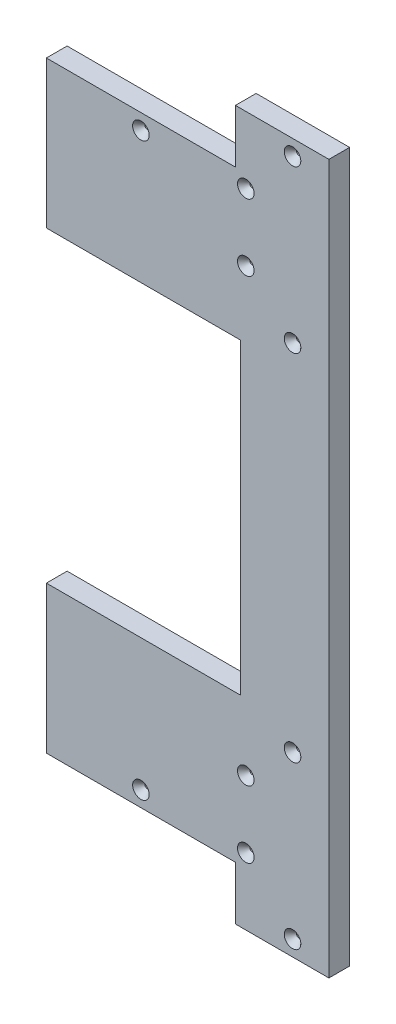
ISO-10303-21;
HEADER;
FILE_DESCRIPTION(('STEP AP214'),'2;1');
FILE_NAME('part.step','',(''),(''),'','','');
FILE_SCHEMA(('AUTOMOTIVE_DESIGN { 1 0 10303 214 1 1 1 1 }'));
ENDSEC;
DATA;
#1=APPLICATION_CONTEXT('core data for automotive mechanical design processes');
#2=APPLICATION_PROTOCOL_DEFINITION('international standard','automotive_design',2000,#1);
#3=PRODUCT_CONTEXT('',#1,'mechanical');
#4=PRODUCT('Part','Part','',(#3));
#5=PRODUCT_RELATED_PRODUCT_CATEGORY('part','',(#4));
#6=PRODUCT_DEFINITION_FORMATION('','',#4);
#7=PRODUCT_DEFINITION_CONTEXT('part definition',#1,'design');
#8=PRODUCT_DEFINITION('design','',#6,#7);
#9=PRODUCT_DEFINITION_SHAPE('','',#8);
#10=(LENGTH_UNIT() NAMED_UNIT(*) SI_UNIT(.MILLI.,.METRE.));
#11=(NAMED_UNIT(*) PLANE_ANGLE_UNIT() SI_UNIT($,.RADIAN.));
#12=(NAMED_UNIT(*) SI_UNIT($,.STERADIAN.) SOLID_ANGLE_UNIT());
#13=UNCERTAINTY_MEASURE_WITH_UNIT(LENGTH_MEASURE(1.E-05),#10,'distance_accuracy_value','');
#14=(GEOMETRIC_REPRESENTATION_CONTEXT(3) GLOBAL_UNCERTAINTY_ASSIGNED_CONTEXT((#13)) GLOBAL_UNIT_ASSIGNED_CONTEXT((#10,
#11,#12)) REPRESENTATION_CONTEXT('',''));
#15=CARTESIAN_POINT('',(0.,0.,0.));
#16=DIRECTION('',(0.,0.,1.));
#17=DIRECTION('',(1.,0.,0.));
#18=AXIS2_PLACEMENT_3D('',#15,#16,#17);
#19=CARTESIAN_POINT('',(-81.8518007051841,-217.299999994015,12.7));
#20=DIRECTION('',(0.,1.,0.));
#21=DIRECTION('',(-1.,0.,0.));
#22=AXIS2_PLACEMENT_3D('',#19,#20,#21);
#23=PLANE('',#22);
#24=DIRECTION('',(1.,0.,0.));
#25=VECTOR('',#24,1.);
#26=CARTESIAN_POINT('',(-81.8518007051841,-217.299999994015,12.7));
#27=LINE('',#26,#25);
#28=CARTESIAN_POINT('',(59.4360614084543,-217.299999994015,12.7));
#29=VERTEX_POINT('',#28);
#30=CARTESIAN_POINT('',(116.730992735781,-217.299999994015,12.7));
#31=VERTEX_POINT('',#30);
#32=EDGE_CURVE('E171',#29,#31,#27,.T.);
#33=ORIENTED_EDGE('',*,*,#32,.F.);
#34=DIRECTION('',(0.,0.,-1.));
#35=VECTOR('',#34,1.);
#36=CARTESIAN_POINT('',(59.4360614084543,-217.299999994015,12.701));
#37=LINE('',#36,#35);
#38=CARTESIAN_POINT('',(59.4360614084543,-217.299999994015,0.));
#39=VERTEX_POINT('',#38);
#40=EDGE_CURVE('E165',#29,#39,#37,.T.);
#41=ORIENTED_EDGE('',*,*,#40,.T.);
#42=DIRECTION('',(1.,0.,0.));
#43=VECTOR('',#42,1.);
#44=CARTESIAN_POINT('',(-81.8518007051841,-217.299999994015,0.));
#45=LINE('',#44,#43);
#46=CARTESIAN_POINT('',(116.730992735781,-217.299999994015,0.));
#47=VERTEX_POINT('',#46);
#48=EDGE_CURVE('E155',#39,#47,#45,.T.);
#49=ORIENTED_EDGE('',*,*,#48,.T.);
#50=DIRECTION('',(0.,0.,-1.));
#51=VECTOR('',#50,1.);
#52=CARTESIAN_POINT('',(116.730992735781,-217.299999994015,12.7));
#53=LINE('',#52,#51);
#54=EDGE_CURVE('E11',#31,#47,#53,.T.);
#55=ORIENTED_EDGE('',*,*,#54,.F.);
#56=EDGE_LOOP('',(#33,#41,#49,#55));
#57=FACE_BOUND('',#56,.T.);
#58=ADVANCED_FACE('F33',(#57),#23,.F.);
#59=CARTESIAN_POINT('',(116.730992735781,217.299999994,12.7));
#60=DIRECTION('',(-1.,0.,0.));
#61=DIRECTION('',(0.,0.,1.));
#62=AXIS2_PLACEMENT_3D('',#59,#60,#61);
#63=PLANE('',#62);
#64=DIRECTION('',(0.,1.,0.));
#65=VECTOR('',#64,1.);
#66=CARTESIAN_POINT('',(116.730992735781,217.299999994,0.));
#67=LINE('',#66,#65);
#68=CARTESIAN_POINT('',(116.730992735781,217.299999994,0.));
#69=VERTEX_POINT('',#68);
#70=EDGE_CURVE('E180',#47,#69,#67,.T.);
#71=ORIENTED_EDGE('',*,*,#70,.T.);
#72=DIRECTION('',(0.,0.,-1.));
#73=VECTOR('',#72,1.);
#74=CARTESIAN_POINT('',(116.730992735781,217.299999994,12.7));
#75=LINE('',#74,#73);
#76=CARTESIAN_POINT('',(116.730992735781,217.299999994,12.7));
#77=VERTEX_POINT('',#76);
#78=EDGE_CURVE('E41',#77,#69,#75,.T.);
#79=ORIENTED_EDGE('',*,*,#78,.F.);
#80=DIRECTION('',(0.,1.,0.));
#81=VECTOR('',#80,1.);
#82=CARTESIAN_POINT('',(116.730992735781,217.299999994,12.7));
#83=LINE('',#82,#81);
#84=EDGE_CURVE('E173',#31,#77,#83,.T.);
#85=ORIENTED_EDGE('',*,*,#84,.F.);
#86=ORIENTED_EDGE('',*,*,#54,.T.);
#87=EDGE_LOOP('',(#71,#79,#85,#86));
#88=FACE_BOUND('',#87,.T.);
#89=ADVANCED_FACE('F311',(#88),#63,.F.);
#90=CARTESIAN_POINT('',(-81.8518007051841,217.299999994,12.7));
#91=DIRECTION('',(0.,-1.,0.));
#92=DIRECTION('',(0.,0.,-1.));
#93=AXIS2_PLACEMENT_3D('',#90,#91,#92);
#94=PLANE('',#93);
#95=DIRECTION('',(-1.,0.,0.));
#96=VECTOR('',#95,1.);
#97=CARTESIAN_POINT('',(-81.8518007051841,217.299999994,0.));
#98=LINE('',#97,#96);
#99=CARTESIAN_POINT('',(59.4360614084512,217.299999994,0.));
#100=VERTEX_POINT('',#99);
#101=EDGE_CURVE('E174',#69,#100,#98,.T.);
#102=ORIENTED_EDGE('',*,*,#101,.T.);
#103=DIRECTION('',(0.,0.,-1.));
#104=VECTOR('',#103,1.);
#105=CARTESIAN_POINT('',(59.4360614084512,217.299999994,12.701));
#106=LINE('',#105,#104);
#107=CARTESIAN_POINT('',(59.4360614084512,217.299999994,12.7));
#108=VERTEX_POINT('',#107);
#109=EDGE_CURVE('E146',#108,#100,#106,.T.);
#110=ORIENTED_EDGE('',*,*,#109,.F.);
#111=DIRECTION('',(-1.,0.,0.));
#112=VECTOR('',#111,1.);
#113=CARTESIAN_POINT('',(-81.8518007051841,217.299999994,12.7));
#114=LINE('',#113,#112);
#115=EDGE_CURVE('E176',#77,#108,#114,.T.);
#116=ORIENTED_EDGE('',*,*,#115,.F.);
#117=ORIENTED_EDGE('',*,*,#78,.T.);
#118=EDGE_LOOP('',(#102,#110,#116,#117));
#119=FACE_BOUND('',#118,.T.);
#120=ADVANCED_FACE('F304',(#119),#94,.F.);
#121=CARTESIAN_POINT('',(0.,0.,12.7));
#122=DIRECTION('',(0.,0.,1.));
#123=DIRECTION('',(1.,0.,0.));
#124=AXIS2_PLACEMENT_3D('',#121,#122,#123);
#125=PLANE('',#124);
#126=CARTESIAN_POINT('',(94.4335270721328,108.649999996999,12.7000000000003));
#127=DIRECTION('',(0.,0.,1.));
#128=DIRECTION('',(1.,0.,0.));
#129=AXIS2_PLACEMENT_3D('',#126,#127,#128);
#130=CIRCLE('',#129,5.08);
#131=CARTESIAN_POINT('',(99.5135270721328,108.649999996999,12.7000000000003));
#132=VERTEX_POINT('',#131);
#133=EDGE_CURVE('E465',#132,#132,#130,.T.);
#134=ORIENTED_EDGE('',*,*,#133,.F.);
#135=EDGE_LOOP('',(#134));
#136=FACE_BOUND('',#135,.T.);
#137=CARTESIAN_POINT('',(94.433527072134,207.77499999399,12.7000000000003));
#138=DIRECTION('',(0.,0.,1.));
#139=DIRECTION('',(1.,0.,0.));
#140=AXIS2_PLACEMENT_3D('',#137,#138,#139);
#141=CIRCLE('',#140,5.08);
#142=CARTESIAN_POINT('',(99.513527072134,207.77499999399,12.7000000000003));
#143=VERTEX_POINT('',#142);
#144=EDGE_CURVE('E232',#143,#143,#141,.T.);
#145=ORIENTED_EDGE('',*,*,#144,.F.);
#146=EDGE_LOOP('',(#145));
#147=FACE_BOUND('',#146,.T.);
#148=CARTESIAN_POINT('',(1.49213035163376,174.999999993984,12.7000000000003));
#149=DIRECTION('',(0.,0.,1.));
#150=DIRECTION('',(1.,0.,0.));
#151=AXIS2_PLACEMENT_3D('',#148,#149,#150);
#152=CIRCLE('',#151,5.08);
#153=CARTESIAN_POINT('',(6.57213035163376,174.999999993984,12.7000000000003));
#154=VERTEX_POINT('',#153);
#155=EDGE_CURVE('E225',#154,#154,#152,.T.);
#156=ORIENTED_EDGE('',*,*,#155,.F.);
#157=EDGE_LOOP('',(#156));
#158=FACE_BOUND('',#157,.T.);
#159=CARTESIAN_POINT('',(65.7860614084621,135.266666662672,12.7000000000003));
#160=DIRECTION('',(0.,0.,1.));
#161=DIRECTION('',(1.,0.,0.));
#162=AXIS2_PLACEMENT_3D('',#159,#160,#161);
#163=CIRCLE('',#162,5.08);
#164=CARTESIAN_POINT('',(70.8660614084621,135.266666662672,12.7000000000003));
#165=VERTEX_POINT('',#164);
#166=EDGE_CURVE('E221',#165,#165,#163,.T.);
#167=ORIENTED_EDGE('',*,*,#166,.F.);
#168=EDGE_LOOP('',(#167));
#169=FACE_BOUND('',#168,.T.);
#170=CARTESIAN_POINT('',(65.7860614084621,176.283333328338,12.7000000000003));
#171=DIRECTION('',(0.,0.,1.));
#172=DIRECTION('',(1.,0.,0.));
#173=AXIS2_PLACEMENT_3D('',#170,#171,#172);
#174=CIRCLE('',#173,5.08);
#175=CARTESIAN_POINT('',(70.8660614084621,176.283333328338,12.7000000000003));
#176=VERTEX_POINT('',#175);
#177=EDGE_CURVE('E217',#176,#176,#174,.T.);
#178=ORIENTED_EDGE('',*,*,#177,.F.);
#179=EDGE_LOOP('',(#178));
#180=FACE_BOUND('',#179,.T.);
#181=CARTESIAN_POINT('',(1.49213035163376,-174.999999993986,12.7000000000003));
#182=DIRECTION('',(0.,0.,1.));
#183=DIRECTION('',(1.,0.,0.));
#184=AXIS2_PLACEMENT_3D('',#181,#182,#183);
#185=CIRCLE('',#184,5.08);
#186=CARTESIAN_POINT('',(6.57213035163376,-174.999999993986,12.7000000000003));
#187=VERTEX_POINT('',#186);
#188=EDGE_CURVE('E212',#187,#187,#185,.T.);
#189=ORIENTED_EDGE('',*,*,#188,.F.);
#190=EDGE_LOOP('',(#189));
#191=FACE_BOUND('',#190,.T.);
#192=CARTESIAN_POINT('',(65.7860614084621,-135.266666662674,12.7000000000003));
#193=DIRECTION('',(0.,0.,1.));
#194=DIRECTION('',(1.,0.,0.));
#195=AXIS2_PLACEMENT_3D('',#192,#193,#194);
#196=CIRCLE('',#195,5.08);
#197=CARTESIAN_POINT('',(70.8660614084621,-135.266666662674,12.7000000000003));
#198=VERTEX_POINT('',#197);
#199=EDGE_CURVE('E207',#198,#198,#196,.T.);
#200=ORIENTED_EDGE('',*,*,#199,.F.);
#201=EDGE_LOOP('',(#200));
#202=FACE_BOUND('',#201,.T.);
#203=CARTESIAN_POINT('',(65.7860614084621,-176.28333332834,12.7000000000003));
#204=DIRECTION('',(0.,0.,1.));
#205=DIRECTION('',(1.,0.,0.));
#206=AXIS2_PLACEMENT_3D('',#203,#204,#205);
#207=CIRCLE('',#206,5.08);
#208=CARTESIAN_POINT('',(70.8660614084621,-176.28333332834,12.7000000000003));
#209=VERTEX_POINT('',#208);
#210=EDGE_CURVE('E202',#209,#209,#207,.T.);
#211=ORIENTED_EDGE('',*,*,#210,.F.);
#212=EDGE_LOOP('',(#211));
#213=FACE_BOUND('',#212,.T.);
#214=CARTESIAN_POINT('',(94.433527072134,-207.774999993992,12.7000000000003));
#215=DIRECTION('',(0.,0.,1.));
#216=DIRECTION('',(1.,0.,0.));
#217=AXIS2_PLACEMENT_3D('',#214,#215,#216);
#218=CIRCLE('',#217,5.08);
#219=CARTESIAN_POINT('',(99.513527072134,-207.774999993992,12.7000000000003));
#220=VERTEX_POINT('',#219);
#221=EDGE_CURVE('E197',#220,#220,#218,.T.);
#222=ORIENTED_EDGE('',*,*,#221,.F.);
#223=EDGE_LOOP('',(#222));
#224=FACE_BOUND('',#223,.T.);
#225=CARTESIAN_POINT('',(94.4335270721328,-108.649999997,12.7000000000003));
#226=DIRECTION('',(0.,0.,1.));
#227=DIRECTION('',(1.,0.,0.));
#228=AXIS2_PLACEMENT_3D('',#225,#226,#227);
#229=CIRCLE('',#228,5.08);
#230=CARTESIAN_POINT('',(99.5135270721328,-108.649999997,12.7000000000003));
#231=VERTEX_POINT('',#230);
#232=EDGE_CURVE('E192',#231,#231,#229,.T.);
#233=ORIENTED_EDGE('',*,*,#232,.F.);
#234=EDGE_LOOP('',(#233));
#235=FACE_BOUND('',#234,.T.);
#236=DIRECTION('',(0.,1.,0.));
#237=VECTOR('',#236,1.);
#238=CARTESIAN_POINT('',(-56.4518007051841,-184.524999994004,12.7));
#239=LINE('',#238,#237);
#240=CARTESIAN_POINT('',(-56.4518007051841,-184.524999994004,12.7));
#241=VERTEX_POINT('',#240);
#242=CARTESIAN_POINT('',(-56.4518007051841,-94.2499999970027,12.7));
#243=VERTEX_POINT('',#242);
#244=EDGE_CURVE('E282',#241,#243,#239,.T.);
#245=ORIENTED_EDGE('',*,*,#244,.F.);
#246=DIRECTION('',(1.,0.,0.));
#247=VECTOR('',#246,1.);
#248=CARTESIAN_POINT('',(59.4360614084543,-184.524999994004,12.7));
#249=LINE('',#248,#247);
#250=CARTESIAN_POINT('',(59.4360614084543,-184.524999994004,12.7));
#251=VERTEX_POINT('',#250);
#252=EDGE_CURVE('E156',#241,#251,#249,.T.);
#253=ORIENTED_EDGE('',*,*,#252,.T.);
#254=DIRECTION('',(0.,-1.,0.));
#255=VECTOR('',#254,1.);
#256=CARTESIAN_POINT('',(59.4360614084543,-184.524999994004,12.7));
#257=LINE('',#256,#255);
#258=EDGE_CURVE('E158',#251,#29,#257,.T.);
#259=ORIENTED_EDGE('',*,*,#258,.T.);
#260=ORIENTED_EDGE('',*,*,#32,.T.);
#261=ORIENTED_EDGE('',*,*,#84,.T.);
#262=ORIENTED_EDGE('',*,*,#115,.T.);
#263=DIRECTION('',(0.,-1.,0.));
#264=VECTOR('',#263,1.);
#265=CARTESIAN_POINT('',(59.4360614084512,184.524999993994,12.7));
#266=LINE('',#265,#264);
#267=CARTESIAN_POINT('',(59.4360614084512,184.524999993994,12.7));
#268=VERTEX_POINT('',#267);
#269=EDGE_CURVE('E148',#108,#268,#266,.T.);
#270=ORIENTED_EDGE('',*,*,#269,.T.);
#271=DIRECTION('',(-1.,0.,0.));
#272=VECTOR('',#271,1.);
#273=CARTESIAN_POINT('',(59.4360614084512,184.524999993994,12.7));
#274=LINE('',#273,#272);
#275=CARTESIAN_POINT('',(-56.4518007051841,184.524999993994,12.7));
#276=VERTEX_POINT('',#275);
#277=EDGE_CURVE('E152',#268,#276,#274,.T.);
#278=ORIENTED_EDGE('',*,*,#277,.T.);
#279=DIRECTION('',(0.,1.,0.));
#280=VECTOR('',#279,1.);
#281=CARTESIAN_POINT('',(-56.4518007051841,184.524999993994,12.7));
#282=LINE('',#281,#280);
#283=CARTESIAN_POINT('',(-56.4518007051841,94.2499999970012,12.7));
#284=VERTEX_POINT('',#283);
#285=EDGE_CURVE('E49',#284,#276,#282,.T.);
#286=ORIENTED_EDGE('',*,*,#285,.F.);
#287=DIRECTION('',(-1.,0.,0.));
#288=VECTOR('',#287,1.);
#289=CARTESIAN_POINT('',(62.6110614084504,94.2499999970012,12.7));
#290=LINE('',#289,#288);
#291=CARTESIAN_POINT('',(62.6110614084504,94.2499999970012,12.7));
#292=VERTEX_POINT('',#291);
#293=EDGE_CURVE('E278',#292,#284,#290,.T.);
#294=ORIENTED_EDGE('',*,*,#293,.F.);
#295=DIRECTION('',(0.,1.,0.));
#296=VECTOR('',#295,1.);
#297=CARTESIAN_POINT('',(62.6110614084504,94.2499999970012,12.7));
#298=LINE('',#297,#296);
#299=CARTESIAN_POINT('',(62.6110614084504,-94.2499999970032,12.7));
#300=VERTEX_POINT('',#299);
#301=EDGE_CURVE('E275',#300,#292,#298,.T.);
#302=ORIENTED_EDGE('',*,*,#301,.F.);
#303=DIRECTION('',(1.,0.,0.));
#304=VECTOR('',#303,1.);
#305=CARTESIAN_POINT('',(62.6110614084504,-94.2499999970032,12.7));
#306=LINE('',#305,#304);
#307=EDGE_CURVE('E285',#243,#300,#306,.T.);
#308=ORIENTED_EDGE('',*,*,#307,.F.);
#309=EDGE_LOOP('',(#245,#253,#259,#260,#261,#262,#270,#278,#286,#294,#302,#308));
#310=FACE_BOUND('',#309,.T.);
#311=ADVANCED_FACE('F299',(#136,#147,#158,#169,#180,#191,#202,#213,#224,#235,#310),#125,.T.);
#312=CARTESIAN_POINT('',(0.,0.,0.));
#313=DIRECTION('',(0.,0.,1.));
#314=DIRECTION('',(1.,0.,0.));
#315=AXIS2_PLACEMENT_3D('',#312,#313,#314);
#316=PLANE('',#315);
#317=CARTESIAN_POINT('',(94.4335270721328,108.649999996999,0.));
#318=DIRECTION('',(0.,0.,1.));
#319=DIRECTION('',(1.,0.,0.));
#320=AXIS2_PLACEMENT_3D('',#317,#318,#319);
#321=CIRCLE('',#320,1.5875);
#322=CARTESIAN_POINT('',(96.0210270721328,108.649999996999,0.));
#323=VERTEX_POINT('',#322);
#324=EDGE_CURVE('E36',#323,#323,#321,.T.);
#325=ORIENTED_EDGE('',*,*,#324,.T.);
#326=EDGE_LOOP('',(#325));
#327=FACE_BOUND('',#326,.T.);
#328=CARTESIAN_POINT('',(94.433527072134,207.77499999399,0.));
#329=DIRECTION('',(0.,0.,1.));
#330=DIRECTION('',(1.,0.,0.));
#331=AXIS2_PLACEMENT_3D('',#328,#329,#330);
#332=CIRCLE('',#331,1.5875);
#333=CARTESIAN_POINT('',(96.021027072134,207.77499999399,0.));
#334=VERTEX_POINT('',#333);
#335=EDGE_CURVE('E223',#334,#334,#332,.T.);
#336=ORIENTED_EDGE('',*,*,#335,.T.);
#337=EDGE_LOOP('',(#336));
#338=FACE_BOUND('',#337,.T.);
#339=CARTESIAN_POINT('',(1.49213035163376,174.999999993984,0.));
#340=DIRECTION('',(0.,0.,1.));
#341=DIRECTION('',(1.,0.,0.));
#342=AXIS2_PLACEMENT_3D('',#339,#340,#341);
#343=CIRCLE('',#342,1.5875);
#344=CARTESIAN_POINT('',(3.07963035163376,174.999999993984,0.));
#345=VERTEX_POINT('',#344);
#346=EDGE_CURVE('E219',#345,#345,#343,.T.);
#347=ORIENTED_EDGE('',*,*,#346,.T.);
#348=EDGE_LOOP('',(#347));
#349=FACE_BOUND('',#348,.T.);
#350=CARTESIAN_POINT('',(65.7860614084621,135.266666662672,0.));
#351=DIRECTION('',(0.,0.,1.));
#352=DIRECTION('',(1.,0.,0.));
#353=AXIS2_PLACEMENT_3D('',#350,#351,#352);
#354=CIRCLE('',#353,1.5875);
#355=CARTESIAN_POINT('',(67.3735614084621,135.266666662672,0.));
#356=VERTEX_POINT('',#355);
#357=EDGE_CURVE('E214',#356,#356,#354,.T.);
#358=ORIENTED_EDGE('',*,*,#357,.T.);
#359=EDGE_LOOP('',(#358));
#360=FACE_BOUND('',#359,.T.);
#361=CARTESIAN_POINT('',(65.7860614084621,176.283333328338,0.));
#362=DIRECTION('',(0.,0.,1.));
#363=DIRECTION('',(1.,0.,0.));
#364=AXIS2_PLACEMENT_3D('',#361,#362,#363);
#365=CIRCLE('',#364,1.5875);
#366=CARTESIAN_POINT('',(67.3735614084621,176.283333328338,0.));
#367=VERTEX_POINT('',#366);
#368=EDGE_CURVE('E209',#367,#367,#365,.T.);
#369=ORIENTED_EDGE('',*,*,#368,.T.);
#370=EDGE_LOOP('',(#369));
#371=FACE_BOUND('',#370,.T.);
#372=CARTESIAN_POINT('',(1.49213035163376,-174.999999993986,0.));
#373=DIRECTION('',(0.,0.,1.));
#374=DIRECTION('',(1.,0.,0.));
#375=AXIS2_PLACEMENT_3D('',#372,#373,#374);
#376=CIRCLE('',#375,1.5875);
#377=CARTESIAN_POINT('',(3.07963035163376,-174.999999993986,0.));
#378=VERTEX_POINT('',#377);
#379=EDGE_CURVE('E204',#378,#378,#376,.T.);
#380=ORIENTED_EDGE('',*,*,#379,.T.);
#381=EDGE_LOOP('',(#380));
#382=FACE_BOUND('',#381,.T.);
#383=CARTESIAN_POINT('',(65.7860614084621,-135.266666662674,0.));
#384=DIRECTION('',(0.,0.,1.));
#385=DIRECTION('',(1.,0.,0.));
#386=AXIS2_PLACEMENT_3D('',#383,#384,#385);
#387=CIRCLE('',#386,1.5875);
#388=CARTESIAN_POINT('',(67.3735614084621,-135.266666662674,0.));
#389=VERTEX_POINT('',#388);
#390=EDGE_CURVE('E199',#389,#389,#387,.T.);
#391=ORIENTED_EDGE('',*,*,#390,.T.);
#392=EDGE_LOOP('',(#391));
#393=FACE_BOUND('',#392,.T.);
#394=CARTESIAN_POINT('',(65.7860614084621,-176.28333332834,0.));
#395=DIRECTION('',(0.,0.,1.));
#396=DIRECTION('',(1.,0.,0.));
#397=AXIS2_PLACEMENT_3D('',#394,#395,#396);
#398=CIRCLE('',#397,1.5875);
#399=CARTESIAN_POINT('',(67.3735614084621,-176.28333332834,0.));
#400=VERTEX_POINT('',#399);
#401=EDGE_CURVE('E194',#400,#400,#398,.T.);
#402=ORIENTED_EDGE('',*,*,#401,.T.);
#403=EDGE_LOOP('',(#402));
#404=FACE_BOUND('',#403,.T.);
#405=CARTESIAN_POINT('',(94.433527072134,-207.774999993992,0.));
#406=DIRECTION('',(0.,0.,1.));
#407=DIRECTION('',(1.,0.,0.));
#408=AXIS2_PLACEMENT_3D('',#405,#406,#407);
#409=CIRCLE('',#408,1.5875);
#410=CARTESIAN_POINT('',(96.021027072134,-207.774999993992,0.));
#411=VERTEX_POINT('',#410);
#412=EDGE_CURVE('E189',#411,#411,#409,.T.);
#413=ORIENTED_EDGE('',*,*,#412,.T.);
#414=EDGE_LOOP('',(#413));
#415=FACE_BOUND('',#414,.T.);
#416=CARTESIAN_POINT('',(94.4335270721328,-108.649999997,0.));
#417=DIRECTION('',(0.,0.,1.));
#418=DIRECTION('',(1.,0.,0.));
#419=AXIS2_PLACEMENT_3D('',#416,#417,#418);
#420=CIRCLE('',#419,1.5875);
#421=CARTESIAN_POINT('',(96.0210270721328,-108.649999997,0.));
#422=VERTEX_POINT('',#421);
#423=EDGE_CURVE('E141',#422,#422,#420,.T.);
#424=ORIENTED_EDGE('',*,*,#423,.T.);
#425=EDGE_LOOP('',(#424));
#426=FACE_BOUND('',#425,.T.);
#427=DIRECTION('',(1.,0.,0.));
#428=VECTOR('',#427,1.);
#429=CARTESIAN_POINT('',(59.4360614084543,-184.524999994004,0.));
#430=LINE('',#429,#428);
#431=CARTESIAN_POINT('',(-56.4518007051841,-184.524999994004,0.));
#432=VERTEX_POINT('',#431);
#433=CARTESIAN_POINT('',(59.4360614084543,-184.524999994004,0.));
#434=VERTEX_POINT('',#433);
#435=EDGE_CURVE('E163',#432,#434,#430,.T.);
#436=ORIENTED_EDGE('',*,*,#435,.F.);
#437=DIRECTION('',(0.,-1.,0.));
#438=VECTOR('',#437,1.);
#439=CARTESIAN_POINT('',(-56.4518007051841,-184.524999994004,0.));
#440=LINE('',#439,#438);
#441=CARTESIAN_POINT('',(-56.4518007051841,-94.2499999970027,0.));
#442=VERTEX_POINT('',#441);
#443=EDGE_CURVE('E273',#442,#432,#440,.T.);
#444=ORIENTED_EDGE('',*,*,#443,.F.);
#445=DIRECTION('',(-1.,0.,0.));
#446=VECTOR('',#445,1.);
#447=CARTESIAN_POINT('',(62.6110614084504,-94.2499999970032,0.));
#448=LINE('',#447,#446);
#449=CARTESIAN_POINT('',(62.6110614084504,-94.2499999970033,0.));
#450=VERTEX_POINT('',#449);
#451=EDGE_CURVE('E271',#450,#442,#448,.T.);
#452=ORIENTED_EDGE('',*,*,#451,.F.);
#453=DIRECTION('',(0.,-1.,0.));
#454=VECTOR('',#453,1.);
#455=CARTESIAN_POINT('',(62.6110614084504,94.2499999970012,0.));
#456=LINE('',#455,#454);
#457=CARTESIAN_POINT('',(62.6110614084504,94.2499999970012,0.));
#458=VERTEX_POINT('',#457);
#459=EDGE_CURVE('E140',#458,#450,#456,.T.);
#460=ORIENTED_EDGE('',*,*,#459,.F.);
#461=DIRECTION('',(1.,0.,0.));
#462=VECTOR('',#461,1.);
#463=CARTESIAN_POINT('',(62.6110614084504,94.2499999970012,0.));
#464=LINE('',#463,#462);
#465=CARTESIAN_POINT('',(-56.4518007051841,94.2499999970012,0.));
#466=VERTEX_POINT('',#465);
#467=EDGE_CURVE('E139',#466,#458,#464,.T.);
#468=ORIENTED_EDGE('',*,*,#467,.F.);
#469=DIRECTION('',(0.,-1.,0.));
#470=VECTOR('',#469,1.);
#471=CARTESIAN_POINT('',(-56.4518007051841,184.524999993994,0.));
#472=LINE('',#471,#470);
#473=CARTESIAN_POINT('',(-56.4518007051841,184.524999993994,0.));
#474=VERTEX_POINT('',#473);
#475=EDGE_CURVE('E124',#474,#466,#472,.T.);
#476=ORIENTED_EDGE('',*,*,#475,.F.);
#477=DIRECTION('',(-1.,0.,0.));
#478=VECTOR('',#477,1.);
#479=CARTESIAN_POINT('',(59.4360614084512,184.524999993994,0.));
#480=LINE('',#479,#478);
#481=CARTESIAN_POINT('',(59.4360614084512,184.524999993994,0.));
#482=VERTEX_POINT('',#481);
#483=EDGE_CURVE('E137',#482,#474,#480,.T.);
#484=ORIENTED_EDGE('',*,*,#483,.F.);
#485=DIRECTION('',(0.,-1.,0.));
#486=VECTOR('',#485,1.);
#487=CARTESIAN_POINT('',(59.4360614084512,184.524999993994,0.));
#488=LINE('',#487,#486);
#489=EDGE_CURVE('E57',#100,#482,#488,.T.);
#490=ORIENTED_EDGE('',*,*,#489,.F.);
#491=ORIENTED_EDGE('',*,*,#101,.F.);
#492=ORIENTED_EDGE('',*,*,#70,.F.);
#493=ORIENTED_EDGE('',*,*,#48,.F.);
#494=DIRECTION('',(0.,-1.,0.));
#495=VECTOR('',#494,1.);
#496=CARTESIAN_POINT('',(59.4360614084543,-184.524999994004,0.));
#497=LINE('',#496,#495);
#498=EDGE_CURVE('E161',#434,#39,#497,.T.);
#499=ORIENTED_EDGE('',*,*,#498,.F.);
#500=EDGE_LOOP('',(#436,#444,#452,#460,#468,#476,#484,#490,#491,#492,#493,#499));
#501=FACE_BOUND('',#500,.T.);
#502=ADVANCED_FACE('F136',(#327,#338,#349,#360,#371,#382,#393,#404,#415,#426,#501),#316,.F.);
#503=CARTESIAN_POINT('',(59.4360614084543,-184.524999994004,12.701));
#504=DIRECTION('',(1.,0.,0.));
#505=DIRECTION('',(0.,1.,0.));
#506=AXIS2_PLACEMENT_3D('',#503,#504,#505);
#507=PLANE('',#506);
#508=DIRECTION('',(0.,0.,-1.));
#509=VECTOR('',#508,1.);
#510=CARTESIAN_POINT('',(59.4360614084543,-184.524999994004,12.701));
#511=LINE('',#510,#509);
#512=EDGE_CURVE('E166',#251,#434,#511,.T.);
#513=ORIENTED_EDGE('',*,*,#512,.T.);
#514=ORIENTED_EDGE('',*,*,#498,.T.);
#515=ORIENTED_EDGE('',*,*,#40,.F.);
#516=ORIENTED_EDGE('',*,*,#258,.F.);
#517=EDGE_LOOP('',(#513,#514,#515,#516));
#518=FACE_BOUND('',#517,.T.);
#519=ADVANCED_FACE('F318',(#518),#507,.F.);
#520=CARTESIAN_POINT('',(59.4360614084543,-184.524999994004,12.701));
#521=DIRECTION('',(0.,1.,0.));
#522=DIRECTION('',(0.,0.,1.));
#523=AXIS2_PLACEMENT_3D('',#520,#521,#522);
#524=PLANE('',#523);
#525=ORIENTED_EDGE('',*,*,#252,.F.);
#526=DIRECTION('',(0.,0.,1.));
#527=VECTOR('',#526,1.);
#528=CARTESIAN_POINT('',(-56.4518007051841,-184.524999994004,-0.000999999999999265));
#529=LINE('',#528,#527);
#530=EDGE_CURVE('E129',#432,#241,#529,.T.);
#531=ORIENTED_EDGE('',*,*,#530,.F.);
#532=ORIENTED_EDGE('',*,*,#435,.T.);
#533=ORIENTED_EDGE('',*,*,#512,.F.);
#534=EDGE_LOOP('',(#525,#531,#532,#533));
#535=FACE_BOUND('',#534,.T.);
#536=ADVANCED_FACE('F324',(#535),#524,.F.);
#537=CARTESIAN_POINT('',(59.4360614084512,184.524999993994,12.701));
#538=DIRECTION('',(1.,0.,0.));
#539=DIRECTION('',(0.,0.,-1.));
#540=AXIS2_PLACEMENT_3D('',#537,#538,#539);
#541=PLANE('',#540);
#542=ORIENTED_EDGE('',*,*,#109,.T.);
#543=ORIENTED_EDGE('',*,*,#489,.T.);
#544=DIRECTION('',(0.,0.,-1.));
#545=VECTOR('',#544,1.);
#546=CARTESIAN_POINT('',(59.4360614084512,184.524999993994,12.701));
#547=LINE('',#546,#545);
#548=EDGE_CURVE('E144',#268,#482,#547,.T.);
#549=ORIENTED_EDGE('',*,*,#548,.F.);
#550=ORIENTED_EDGE('',*,*,#269,.F.);
#551=EDGE_LOOP('',(#542,#543,#549,#550));
#552=FACE_BOUND('',#551,.T.);
#553=ADVANCED_FACE('F302',(#552),#541,.F.);
#554=CARTESIAN_POINT('',(59.4360614084512,184.524999993994,12.701));
#555=DIRECTION('',(0.,-1.,0.));
#556=DIRECTION('',(1.,0.,0.));
#557=AXIS2_PLACEMENT_3D('',#554,#555,#556);
#558=PLANE('',#557);
#559=ORIENTED_EDGE('',*,*,#483,.T.);
#560=DIRECTION('',(0.,0.,1.));
#561=VECTOR('',#560,1.);
#562=CARTESIAN_POINT('',(-56.4518007051841,184.524999993994,-0.000999999999999265));
#563=LINE('',#562,#561);
#564=EDGE_CURVE('E121',#474,#276,#563,.T.);
#565=ORIENTED_EDGE('',*,*,#564,.T.);
#566=ORIENTED_EDGE('',*,*,#277,.F.);
#567=ORIENTED_EDGE('',*,*,#548,.T.);
#568=EDGE_LOOP('',(#559,#565,#566,#567));
#569=FACE_BOUND('',#568,.T.);
#570=ADVANCED_FACE('F143',(#569),#558,.F.);
#571=CARTESIAN_POINT('',(62.6110614084504,94.2499999970012,-0.000999999999999265));
#572=DIRECTION('',(1.,0.,0.));
#573=DIRECTION('',(0.,1.,0.));
#574=AXIS2_PLACEMENT_3D('',#571,#572,#573);
#575=PLANE('',#574);
#576=ORIENTED_EDGE('',*,*,#459,.T.);
#577=DIRECTION('',(0.,0.,1.));
#578=VECTOR('',#577,1.);
#579=CARTESIAN_POINT('',(62.6110614084504,-94.2499999970032,-0.000999999999999265));
#580=LINE('',#579,#578);
#581=EDGE_CURVE('E289',#450,#300,#580,.T.);
#582=ORIENTED_EDGE('',*,*,#581,.T.);
#583=ORIENTED_EDGE('',*,*,#301,.T.);
#584=DIRECTION('',(0.,0.,1.));
#585=VECTOR('',#584,1.);
#586=CARTESIAN_POINT('',(62.6110614084504,94.2499999970012,-0.000999999999999265));
#587=LINE('',#586,#585);
#588=EDGE_CURVE('E288',#458,#292,#587,.T.);
#589=ORIENTED_EDGE('',*,*,#588,.F.);
#590=EDGE_LOOP('',(#576,#582,#583,#589));
#591=FACE_BOUND('',#590,.T.);
#592=ADVANCED_FACE('F335',(#591),#575,.F.);
#593=CARTESIAN_POINT('',(62.6110614084504,-94.2499999970032,-0.000999999999999265));
#594=DIRECTION('',(0.,-1.,0.));
#595=DIRECTION('',(1.,0.,0.));
#596=AXIS2_PLACEMENT_3D('',#593,#594,#595);
#597=PLANE('',#596);
#598=ORIENTED_EDGE('',*,*,#451,.T.);
#599=DIRECTION('',(0.,0.,1.));
#600=VECTOR('',#599,1.);
#601=CARTESIAN_POINT('',(-56.4518007051841,-94.2499999970027,-0.000999999999999265));
#602=LINE('',#601,#600);
#603=EDGE_CURVE('E291',#442,#243,#602,.T.);
#604=ORIENTED_EDGE('',*,*,#603,.T.);
#605=ORIENTED_EDGE('',*,*,#307,.T.);
#606=ORIENTED_EDGE('',*,*,#581,.F.);
#607=EDGE_LOOP('',(#598,#604,#605,#606));
#608=FACE_BOUND('',#607,.T.);
#609=ADVANCED_FACE('F331',(#608),#597,.F.);
#610=CARTESIAN_POINT('',(-56.4518007051841,-184.524999994004,-0.000999999999999265));
#611=DIRECTION('',(1.,0.,0.));
#612=DIRECTION('',(0.,0.,-1.));
#613=AXIS2_PLACEMENT_3D('',#610,#611,#612);
#614=PLANE('',#613);
#615=ORIENTED_EDGE('',*,*,#443,.T.);
#616=ORIENTED_EDGE('',*,*,#530,.T.);
#617=ORIENTED_EDGE('',*,*,#244,.T.);
#618=ORIENTED_EDGE('',*,*,#603,.F.);
#619=EDGE_LOOP('',(#615,#616,#617,#618));
#620=FACE_BOUND('',#619,.T.);
#621=ADVANCED_FACE('F329',(#620),#614,.F.);
#622=CARTESIAN_POINT('',(-56.4518007051841,184.524999993994,-0.000999999999999265));
#623=DIRECTION('',(1.,0.,0.));
#624=DIRECTION('',(0.,1.,0.));
#625=AXIS2_PLACEMENT_3D('',#622,#623,#624);
#626=PLANE('',#625);
#627=ORIENTED_EDGE('',*,*,#475,.T.);
#628=DIRECTION('',(0.,0.,1.));
#629=VECTOR('',#628,1.);
#630=CARTESIAN_POINT('',(-56.4518007051841,94.2499999970012,-0.000999999999999265));
#631=LINE('',#630,#629);
#632=EDGE_CURVE('E130',#466,#284,#631,.T.);
#633=ORIENTED_EDGE('',*,*,#632,.T.);
#634=ORIENTED_EDGE('',*,*,#285,.T.);
#635=ORIENTED_EDGE('',*,*,#564,.F.);
#636=EDGE_LOOP('',(#627,#633,#634,#635));
#637=FACE_BOUND('',#636,.T.);
#638=ADVANCED_FACE('F123',(#637),#626,.F.);
#639=CARTESIAN_POINT('',(62.6110614084504,94.2499999970012,-0.000999999999999265));
#640=DIRECTION('',(0.,1.,0.));
#641=DIRECTION('',(-1.,0.,0.));
#642=AXIS2_PLACEMENT_3D('',#639,#640,#641);
#643=PLANE('',#642);
#644=ORIENTED_EDGE('',*,*,#467,.T.);
#645=ORIENTED_EDGE('',*,*,#588,.T.);
#646=ORIENTED_EDGE('',*,*,#293,.T.);
#647=ORIENTED_EDGE('',*,*,#632,.F.);
#648=EDGE_LOOP('',(#644,#645,#646,#647));
#649=FACE_BOUND('',#648,.T.);
#650=ADVANCED_FACE('F339',(#649),#643,.F.);
#651=CARTESIAN_POINT('',(94.4335270721328,-108.649999997,12.7000000000003));
#652=DIRECTION('',(0.,0.,1.));
#653=DIRECTION('',(1.,0.,0.));
#654=AXIS2_PLACEMENT_3D('',#651,#652,#653);
#655=CYLINDRICAL_SURFACE('',#654,1.5875);
#656=CARTESIAN_POINT('',(94.4335270721328,-108.649999997,8.68233833778091));
#657=DIRECTION('',(0.,0.,1.));
#658=DIRECTION('',(1.,0.,0.));
#659=AXIS2_PLACEMENT_3D('',#656,#657,#658);
#660=CIRCLE('',#659,1.58750000000001);
#661=CARTESIAN_POINT('',(96.0210270721328,-108.649999997,8.68233833778091));
#662=VERTEX_POINT('',#661);
#663=EDGE_CURVE('E188',#662,#662,#660,.T.);
#664=ORIENTED_EDGE('',*,*,#663,.T.);
#665=EDGE_LOOP('',(#664));
#666=FACE_BOUND('',#665,.T.);
#667=ORIENTED_EDGE('',*,*,#423,.F.);
#668=EDGE_LOOP('',(#667));
#669=FACE_BOUND('',#668,.T.);
#670=ADVANCED_FACE('F341',(#666,#669),#655,.F.);
#671=CARTESIAN_POINT('',(94.4335270721328,-108.649999997,12.7000000000003));
#672=DIRECTION('',(0.,0.,1.));
#673=DIRECTION('',(1.,0.,0.));
#674=AXIS2_PLACEMENT_3D('',#671,#672,#673);
#675=CONICAL_SURFACE('',#674,5.08,0.715584993317677);
#676=ORIENTED_EDGE('',*,*,#663,.F.);
#677=EDGE_LOOP('',(#676));
#678=FACE_BOUND('',#677,.T.);
#679=ORIENTED_EDGE('',*,*,#232,.T.);
#680=EDGE_LOOP('',(#679));
#681=FACE_BOUND('',#680,.T.);
#682=ADVANCED_FACE('F347',(#678,#681),#675,.F.);
#683=CARTESIAN_POINT('',(94.433527072134,-207.774999993992,12.7000000000003));
#684=DIRECTION('',(0.,0.,1.));
#685=DIRECTION('',(1.,0.,0.));
#686=AXIS2_PLACEMENT_3D('',#683,#684,#685);
#687=CYLINDRICAL_SURFACE('',#686,1.5875);
#688=CARTESIAN_POINT('',(94.433527072134,-207.774999993992,8.68233833778091));
#689=DIRECTION('',(0.,0.,1.));
#690=DIRECTION('',(1.,0.,0.));
#691=AXIS2_PLACEMENT_3D('',#688,#689,#690);
#692=CIRCLE('',#691,1.58750000000001);
#693=CARTESIAN_POINT('',(96.021027072134,-207.774999993992,8.68233833778091));
#694=VERTEX_POINT('',#693);
#695=EDGE_CURVE('E193',#694,#694,#692,.T.);
#696=ORIENTED_EDGE('',*,*,#695,.T.);
#697=EDGE_LOOP('',(#696));
#698=FACE_BOUND('',#697,.T.);
#699=ORIENTED_EDGE('',*,*,#412,.F.);
#700=EDGE_LOOP('',(#699));
#701=FACE_BOUND('',#700,.T.);
#702=ADVANCED_FACE('F386',(#698,#701),#687,.F.);
#703=CARTESIAN_POINT('',(94.433527072134,-207.774999993992,12.7000000000003));
#704=DIRECTION('',(0.,0.,1.));
#705=DIRECTION('',(1.,0.,0.));
#706=AXIS2_PLACEMENT_3D('',#703,#704,#705);
#707=CONICAL_SURFACE('',#706,5.08,0.715584993317677);
#708=ORIENTED_EDGE('',*,*,#695,.F.);
#709=EDGE_LOOP('',(#708));
#710=FACE_BOUND('',#709,.T.);
#711=ORIENTED_EDGE('',*,*,#221,.T.);
#712=EDGE_LOOP('',(#711));
#713=FACE_BOUND('',#712,.T.);
#714=ADVANCED_FACE('F390',(#710,#713),#707,.F.);
#715=CARTESIAN_POINT('',(65.7860614084621,-176.28333332834,12.7000000000003));
#716=DIRECTION('',(0.,0.,1.));
#717=DIRECTION('',(1.,0.,0.));
#718=AXIS2_PLACEMENT_3D('',#715,#716,#717);
#719=CYLINDRICAL_SURFACE('',#718,1.5875);
#720=CARTESIAN_POINT('',(65.7860614084621,-176.28333332834,8.68233833778091));
#721=DIRECTION('',(0.,0.,1.));
#722=DIRECTION('',(1.,0.,0.));
#723=AXIS2_PLACEMENT_3D('',#720,#721,#722);
#724=CIRCLE('',#723,1.58750000000001);
#725=CARTESIAN_POINT('',(67.3735614084621,-176.28333332834,8.68233833778091));
#726=VERTEX_POINT('',#725);
#727=EDGE_CURVE('E198',#726,#726,#724,.T.);
#728=ORIENTED_EDGE('',*,*,#727,.T.);
#729=EDGE_LOOP('',(#728));
#730=FACE_BOUND('',#729,.T.);
#731=ORIENTED_EDGE('',*,*,#401,.F.);
#732=EDGE_LOOP('',(#731));
#733=FACE_BOUND('',#732,.T.);
#734=ADVANCED_FACE('F394',(#730,#733),#719,.F.);
#735=CARTESIAN_POINT('',(65.7860614084621,-176.28333332834,12.7000000000003));
#736=DIRECTION('',(0.,0.,1.));
#737=DIRECTION('',(1.,0.,0.));
#738=AXIS2_PLACEMENT_3D('',#735,#736,#737);
#739=CONICAL_SURFACE('',#738,5.08,0.715584993317677);
#740=ORIENTED_EDGE('',*,*,#727,.F.);
#741=EDGE_LOOP('',(#740));
#742=FACE_BOUND('',#741,.T.);
#743=ORIENTED_EDGE('',*,*,#210,.T.);
#744=EDGE_LOOP('',(#743));
#745=FACE_BOUND('',#744,.T.);
#746=ADVANCED_FACE('F398',(#742,#745),#739,.F.);
#747=CARTESIAN_POINT('',(65.7860614084621,-135.266666662674,12.7000000000003));
#748=DIRECTION('',(0.,0.,1.));
#749=DIRECTION('',(1.,0.,0.));
#750=AXIS2_PLACEMENT_3D('',#747,#748,#749);
#751=CYLINDRICAL_SURFACE('',#750,1.5875);
#752=CARTESIAN_POINT('',(65.7860614084621,-135.266666662674,8.68233833778091));
#753=DIRECTION('',(0.,0.,1.));
#754=DIRECTION('',(1.,0.,0.));
#755=AXIS2_PLACEMENT_3D('',#752,#753,#754);
#756=CIRCLE('',#755,1.58750000000001);
#757=CARTESIAN_POINT('',(67.3735614084621,-135.266666662674,8.68233833778091));
#758=VERTEX_POINT('',#757);
#759=EDGE_CURVE('E203',#758,#758,#756,.T.);
#760=ORIENTED_EDGE('',*,*,#759,.T.);
#761=EDGE_LOOP('',(#760));
#762=FACE_BOUND('',#761,.T.);
#763=ORIENTED_EDGE('',*,*,#390,.F.);
#764=EDGE_LOOP('',(#763));
#765=FACE_BOUND('',#764,.T.);
#766=ADVANCED_FACE('F402',(#762,#765),#751,.F.);
#767=CARTESIAN_POINT('',(65.7860614084621,-135.266666662674,12.7000000000003));
#768=DIRECTION('',(0.,0.,1.));
#769=DIRECTION('',(1.,0.,0.));
#770=AXIS2_PLACEMENT_3D('',#767,#768,#769);
#771=CONICAL_SURFACE('',#770,5.08,0.715584993317677);
#772=ORIENTED_EDGE('',*,*,#759,.F.);
#773=EDGE_LOOP('',(#772));
#774=FACE_BOUND('',#773,.T.);
#775=ORIENTED_EDGE('',*,*,#199,.T.);
#776=EDGE_LOOP('',(#775));
#777=FACE_BOUND('',#776,.T.);
#778=ADVANCED_FACE('F406',(#774,#777),#771,.F.);
#779=CARTESIAN_POINT('',(1.49213035163376,-174.999999993986,12.7000000000003));
#780=DIRECTION('',(0.,0.,1.));
#781=DIRECTION('',(1.,0.,0.));
#782=AXIS2_PLACEMENT_3D('',#779,#780,#781);
#783=CYLINDRICAL_SURFACE('',#782,1.5875);
#784=CARTESIAN_POINT('',(1.49213035163376,-174.999999993986,8.68233833778091));
#785=DIRECTION('',(0.,0.,1.));
#786=DIRECTION('',(1.,0.,0.));
#787=AXIS2_PLACEMENT_3D('',#784,#785,#786);
#788=CIRCLE('',#787,1.5875);
#789=CARTESIAN_POINT('',(3.07963035163376,-174.999999993986,8.68233833778091));
#790=VERTEX_POINT('',#789);
#791=EDGE_CURVE('E208',#790,#790,#788,.T.);
#792=ORIENTED_EDGE('',*,*,#791,.T.);
#793=EDGE_LOOP('',(#792));
#794=FACE_BOUND('',#793,.T.);
#795=ORIENTED_EDGE('',*,*,#379,.F.);
#796=EDGE_LOOP('',(#795));
#797=FACE_BOUND('',#796,.T.);
#798=ADVANCED_FACE('F410',(#794,#797),#783,.F.);
#799=CARTESIAN_POINT('',(1.49213035163376,-174.999999993986,12.7000000000003));
#800=DIRECTION('',(0.,0.,1.));
#801=DIRECTION('',(1.,0.,0.));
#802=AXIS2_PLACEMENT_3D('',#799,#800,#801);
#803=CONICAL_SURFACE('',#802,5.08,0.715584993317677);
#804=ORIENTED_EDGE('',*,*,#791,.F.);
#805=EDGE_LOOP('',(#804));
#806=FACE_BOUND('',#805,.T.);
#807=ORIENTED_EDGE('',*,*,#188,.T.);
#808=EDGE_LOOP('',(#807));
#809=FACE_BOUND('',#808,.T.);
#810=ADVANCED_FACE('F414',(#806,#809),#803,.F.);
#811=CARTESIAN_POINT('',(65.7860614084621,176.283333328338,12.7000000000003));
#812=DIRECTION('',(0.,0.,1.));
#813=DIRECTION('',(1.,0.,0.));
#814=AXIS2_PLACEMENT_3D('',#811,#812,#813);
#815=CYLINDRICAL_SURFACE('',#814,1.5875);
#816=CARTESIAN_POINT('',(65.7860614084621,176.283333328338,8.68233833778091));
#817=DIRECTION('',(0.,0.,1.));
#818=DIRECTION('',(1.,0.,0.));
#819=AXIS2_PLACEMENT_3D('',#816,#817,#818);
#820=CIRCLE('',#819,1.58750000000001);
#821=CARTESIAN_POINT('',(67.3735614084621,176.283333328338,8.68233833778091));
#822=VERTEX_POINT('',#821);
#823=EDGE_CURVE('E213',#822,#822,#820,.T.);
#824=ORIENTED_EDGE('',*,*,#823,.T.);
#825=EDGE_LOOP('',(#824));
#826=FACE_BOUND('',#825,.T.);
#827=ORIENTED_EDGE('',*,*,#368,.F.);
#828=EDGE_LOOP('',(#827));
#829=FACE_BOUND('',#828,.T.);
#830=ADVANCED_FACE('F418',(#826,#829),#815,.F.);
#831=CARTESIAN_POINT('',(65.7860614084621,176.283333328338,12.7000000000003));
#832=DIRECTION('',(0.,0.,1.));
#833=DIRECTION('',(1.,0.,0.));
#834=AXIS2_PLACEMENT_3D('',#831,#832,#833);
#835=CONICAL_SURFACE('',#834,5.08,0.715584993317677);
#836=ORIENTED_EDGE('',*,*,#823,.F.);
#837=EDGE_LOOP('',(#836));
#838=FACE_BOUND('',#837,.T.);
#839=ORIENTED_EDGE('',*,*,#177,.T.);
#840=EDGE_LOOP('',(#839));
#841=FACE_BOUND('',#840,.T.);
#842=ADVANCED_FACE('F422',(#838,#841),#835,.F.);
#843=CARTESIAN_POINT('',(65.7860614084621,135.266666662672,12.7000000000003));
#844=DIRECTION('',(0.,0.,1.));
#845=DIRECTION('',(1.,0.,0.));
#846=AXIS2_PLACEMENT_3D('',#843,#844,#845);
#847=CYLINDRICAL_SURFACE('',#846,1.5875);
#848=CARTESIAN_POINT('',(65.7860614084621,135.266666662672,8.68233833778091));
#849=DIRECTION('',(0.,0.,1.));
#850=DIRECTION('',(1.,0.,0.));
#851=AXIS2_PLACEMENT_3D('',#848,#849,#850);
#852=CIRCLE('',#851,1.58750000000001);
#853=CARTESIAN_POINT('',(67.3735614084621,135.266666662672,8.68233833778091));
#854=VERTEX_POINT('',#853);
#855=EDGE_CURVE('E218',#854,#854,#852,.T.);
#856=ORIENTED_EDGE('',*,*,#855,.T.);
#857=EDGE_LOOP('',(#856));
#858=FACE_BOUND('',#857,.T.);
#859=ORIENTED_EDGE('',*,*,#357,.F.);
#860=EDGE_LOOP('',(#859));
#861=FACE_BOUND('',#860,.T.);
#862=ADVANCED_FACE('F426',(#858,#861),#847,.F.);
#863=CARTESIAN_POINT('',(65.7860614084621,135.266666662672,12.7000000000003));
#864=DIRECTION('',(0.,0.,1.));
#865=DIRECTION('',(1.,0.,0.));
#866=AXIS2_PLACEMENT_3D('',#863,#864,#865);
#867=CONICAL_SURFACE('',#866,5.08,0.715584993317677);
#868=ORIENTED_EDGE('',*,*,#855,.F.);
#869=EDGE_LOOP('',(#868));
#870=FACE_BOUND('',#869,.T.);
#871=ORIENTED_EDGE('',*,*,#166,.T.);
#872=EDGE_LOOP('',(#871));
#873=FACE_BOUND('',#872,.T.);
#874=ADVANCED_FACE('F430',(#870,#873),#867,.F.);
#875=CARTESIAN_POINT('',(1.49213035163376,174.999999993984,12.7000000000003));
#876=DIRECTION('',(0.,0.,1.));
#877=DIRECTION('',(1.,0.,0.));
#878=AXIS2_PLACEMENT_3D('',#875,#876,#877);
#879=CYLINDRICAL_SURFACE('',#878,1.5875);
#880=CARTESIAN_POINT('',(1.49213035163376,174.999999993984,8.68233833778091));
#881=DIRECTION('',(0.,0.,1.));
#882=DIRECTION('',(1.,0.,0.));
#883=AXIS2_PLACEMENT_3D('',#880,#881,#882);
#884=CIRCLE('',#883,1.5875);
#885=CARTESIAN_POINT('',(3.07963035163376,174.999999993984,8.68233833778091));
#886=VERTEX_POINT('',#885);
#887=EDGE_CURVE('E222',#886,#886,#884,.T.);
#888=ORIENTED_EDGE('',*,*,#887,.T.);
#889=EDGE_LOOP('',(#888));
#890=FACE_BOUND('',#889,.T.);
#891=ORIENTED_EDGE('',*,*,#346,.F.);
#892=EDGE_LOOP('',(#891));
#893=FACE_BOUND('',#892,.T.);
#894=ADVANCED_FACE('F434',(#890,#893),#879,.F.);
#895=CARTESIAN_POINT('',(1.49213035163376,174.999999993984,12.7000000000003));
#896=DIRECTION('',(0.,0.,1.));
#897=DIRECTION('',(1.,0.,0.));
#898=AXIS2_PLACEMENT_3D('',#895,#896,#897);
#899=CONICAL_SURFACE('',#898,5.08,0.715584993317677);
#900=ORIENTED_EDGE('',*,*,#887,.F.);
#901=EDGE_LOOP('',(#900));
#902=FACE_BOUND('',#901,.T.);
#903=ORIENTED_EDGE('',*,*,#155,.T.);
#904=EDGE_LOOP('',(#903));
#905=FACE_BOUND('',#904,.T.);
#906=ADVANCED_FACE('F438',(#902,#905),#899,.F.);
#907=CARTESIAN_POINT('',(94.433527072134,207.77499999399,12.7000000000003));
#908=DIRECTION('',(0.,0.,1.));
#909=DIRECTION('',(1.,0.,0.));
#910=AXIS2_PLACEMENT_3D('',#907,#908,#909);
#911=CYLINDRICAL_SURFACE('',#910,1.5875);
#912=CARTESIAN_POINT('',(94.433527072134,207.77499999399,8.68233833778091));
#913=DIRECTION('',(0.,0.,1.));
#914=DIRECTION('',(1.,0.,0.));
#915=AXIS2_PLACEMENT_3D('',#912,#913,#914);
#916=CIRCLE('',#915,1.58750000000001);
#917=CARTESIAN_POINT('',(96.021027072134,207.77499999399,8.68233833778091));
#918=VERTEX_POINT('',#917);
#919=EDGE_CURVE('E226',#918,#918,#916,.T.);
#920=ORIENTED_EDGE('',*,*,#919,.T.);
#921=EDGE_LOOP('',(#920));
#922=FACE_BOUND('',#921,.T.);
#923=ORIENTED_EDGE('',*,*,#335,.F.);
#924=EDGE_LOOP('',(#923));
#925=FACE_BOUND('',#924,.T.);
#926=ADVANCED_FACE('F442',(#922,#925),#911,.F.);
#927=CARTESIAN_POINT('',(94.433527072134,207.77499999399,12.7000000000003));
#928=DIRECTION('',(0.,0.,1.));
#929=DIRECTION('',(1.,0.,0.));
#930=AXIS2_PLACEMENT_3D('',#927,#928,#929);
#931=CONICAL_SURFACE('',#930,5.08,0.715584993317677);
#932=ORIENTED_EDGE('',*,*,#919,.F.);
#933=EDGE_LOOP('',(#932));
#934=FACE_BOUND('',#933,.T.);
#935=ORIENTED_EDGE('',*,*,#144,.T.);
#936=EDGE_LOOP('',(#935));
#937=FACE_BOUND('',#936,.T.);
#938=ADVANCED_FACE('F446',(#934,#937),#931,.F.);
#939=CARTESIAN_POINT('',(94.4335270721328,108.649999996999,12.7000000000003));
#940=DIRECTION('',(0.,0.,1.));
#941=DIRECTION('',(1.,0.,0.));
#942=AXIS2_PLACEMENT_3D('',#939,#940,#941);
#943=CYLINDRICAL_SURFACE('',#942,1.5875);
#944=CARTESIAN_POINT('',(94.4335270721328,108.649999996999,8.68233833778091));
#945=DIRECTION('',(0.,0.,1.));
#946=DIRECTION('',(1.,0.,0.));
#947=AXIS2_PLACEMENT_3D('',#944,#945,#946);
#948=CIRCLE('',#947,1.58750000000001);
#949=CARTESIAN_POINT('',(96.0210270721328,108.649999996999,8.68233833778091));
#950=VERTEX_POINT('',#949);
#951=EDGE_CURVE('E462',#950,#950,#948,.T.);
#952=ORIENTED_EDGE('',*,*,#951,.T.);
#953=EDGE_LOOP('',(#952));
#954=FACE_BOUND('',#953,.T.);
#955=ORIENTED_EDGE('',*,*,#324,.F.);
#956=EDGE_LOOP('',(#955));
#957=FACE_BOUND('',#956,.T.);
#958=ADVANCED_FACE('F449',(#954,#957),#943,.F.);
#959=CARTESIAN_POINT('',(94.4335270721328,108.649999996999,12.7000000000003));
#960=DIRECTION('',(0.,0.,1.));
#961=DIRECTION('',(1.,0.,0.));
#962=AXIS2_PLACEMENT_3D('',#959,#960,#961);
#963=CONICAL_SURFACE('',#962,5.08,0.715584993317677);
#964=ORIENTED_EDGE('',*,*,#951,.F.);
#965=EDGE_LOOP('',(#964));
#966=FACE_BOUND('',#965,.T.);
#967=ORIENTED_EDGE('',*,*,#133,.T.);
#968=EDGE_LOOP('',(#967));
#969=FACE_BOUND('',#968,.T.);
#970=ADVANCED_FACE('F453',(#966,#969),#963,.F.);
#971=CLOSED_SHELL('',(#58,#89,#120,#311,#502,#519,#536,#553,#570,#592,#609,#621,#638,#650,#670,
#682,#702,#714,#734,#746,#766,#778,#798,#810,#830,#842,#862,#874,#894,#906,#926,#938,#958,#970));
#972=MANIFOLD_SOLID_BREP('B2',#971);
#973=ADVANCED_BREP_SHAPE_REPRESENTATION('',(#18,#972),#14);
#974=SHAPE_DEFINITION_REPRESENTATION(#9,#973);
ENDSEC;
END-ISO-10303-21;
